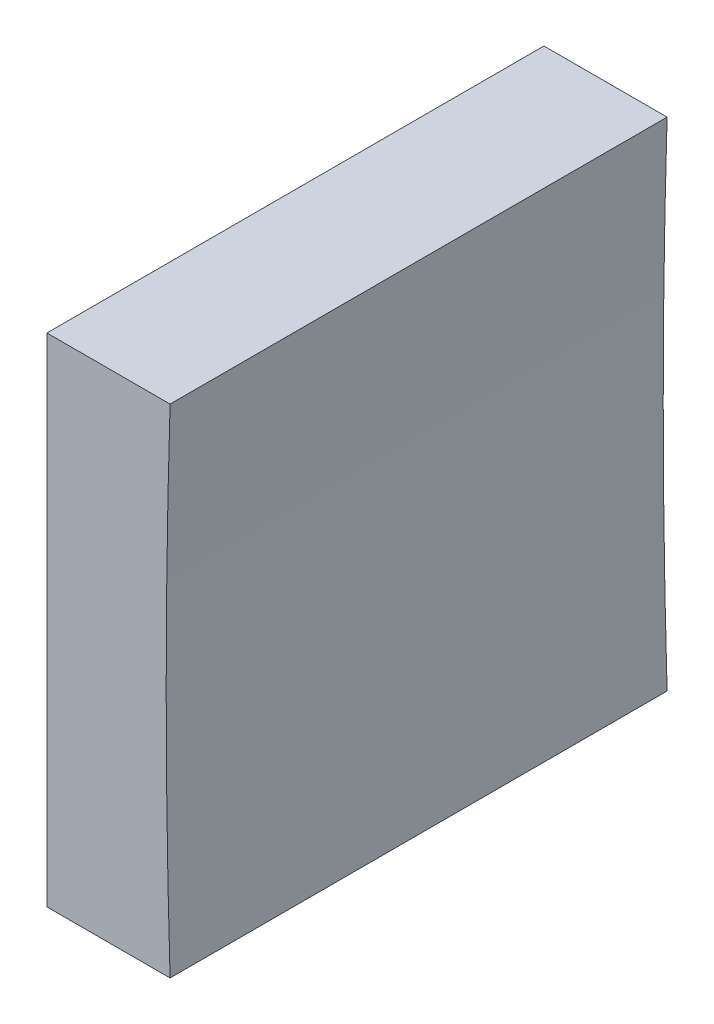
ISO-10303-21;
HEADER;
FILE_DESCRIPTION(('STEP AP214'),'2;1');
FILE_NAME('part.step','',(''),(''),'','','');
FILE_SCHEMA(('AUTOMOTIVE_DESIGN { 1 0 10303 214 1 1 1 1 }'));
ENDSEC;
DATA;
#1=APPLICATION_CONTEXT('core data for automotive mechanical design processes');
#2=APPLICATION_PROTOCOL_DEFINITION('international standard','automotive_design',2000,#1);
#3=PRODUCT_CONTEXT('',#1,'mechanical');
#4=PRODUCT('Part','Part','',(#3));
#5=PRODUCT_RELATED_PRODUCT_CATEGORY('part','',(#4));
#6=PRODUCT_DEFINITION_FORMATION('','',#4);
#7=PRODUCT_DEFINITION_CONTEXT('part definition',#1,'design');
#8=PRODUCT_DEFINITION('design','',#6,#7);
#9=PRODUCT_DEFINITION_SHAPE('','',#8);
#10=(LENGTH_UNIT() NAMED_UNIT(*) SI_UNIT(.MILLI.,.METRE.));
#11=(NAMED_UNIT(*) PLANE_ANGLE_UNIT() SI_UNIT($,.RADIAN.));
#12=(NAMED_UNIT(*) SI_UNIT($,.STERADIAN.) SOLID_ANGLE_UNIT());
#13=UNCERTAINTY_MEASURE_WITH_UNIT(LENGTH_MEASURE(1.E-05),#10,'distance_accuracy_value','');
#14=(GEOMETRIC_REPRESENTATION_CONTEXT(3) GLOBAL_UNCERTAINTY_ASSIGNED_CONTEXT((#13)) GLOBAL_UNIT_ASSIGNED_CONTEXT((#10,
#11,#12)) REPRESENTATION_CONTEXT('',''));
#15=CARTESIAN_POINT('',(0.,0.,0.));
#16=DIRECTION('',(0.,0.,1.));
#17=DIRECTION('',(1.,0.,0.));
#18=AXIS2_PLACEMENT_3D('',#15,#16,#17);
#19=CARTESIAN_POINT('',(290.902495825364,54.3579292677673,25.));
#20=DIRECTION('',(0.,1.,0.));
#21=DIRECTION('',(-1.,0.,0.));
#22=AXIS2_PLACEMENT_3D('',#19,#20,#21);
#23=PLANE('',#22);
#24=DIRECTION('',(1.,0.,0.));
#25=VECTOR('',#24,1.);
#26=CARTESIAN_POINT('',(290.902495825364,54.3579292677673,0.));
#27=LINE('',#26,#25);
#28=CARTESIAN_POINT('',(284.707135631282,54.3579292677671,0.));
#29=VERTEX_POINT('',#28);
#30=CARTESIAN_POINT('',(290.902495825364,54.3579292677674,0.));
#31=VERTEX_POINT('',#30);
#32=EDGE_CURVE('E91',#29,#31,#27,.T.);
#33=ORIENTED_EDGE('',*,*,#32,.T.);
#34=DIRECTION('',(0.,0.,-1.));
#35=VECTOR('',#34,1.);
#36=CARTESIAN_POINT('',(290.902495825364,54.3579292677674,25.));
#37=LINE('',#36,#35);
#38=CARTESIAN_POINT('',(290.902495825364,54.3579292677674,25.));
#39=VERTEX_POINT('',#38);
#40=EDGE_CURVE('E45',#39,#31,#37,.T.);
#41=ORIENTED_EDGE('',*,*,#40,.F.);
#42=DIRECTION('',(1.,0.,0.));
#43=VECTOR('',#42,1.);
#44=CARTESIAN_POINT('',(290.902495825364,54.3579292677673,25.));
#45=LINE('',#44,#43);
#46=CARTESIAN_POINT('',(284.707135631282,54.3579292677671,25.));
#47=VERTEX_POINT('',#46);
#48=EDGE_CURVE('E84',#47,#39,#45,.T.);
#49=ORIENTED_EDGE('',*,*,#48,.F.);
#50=DIRECTION('',(0.,0.,-1.));
#51=VECTOR('',#50,1.);
#52=CARTESIAN_POINT('',(284.707135631282,54.3579292677671,25.));
#53=LINE('',#52,#51);
#54=EDGE_CURVE('E11',#47,#29,#53,.T.);
#55=ORIENTED_EDGE('',*,*,#54,.T.);
#56=EDGE_LOOP('',(#33,#41,#49,#55));
#57=FACE_BOUND('',#56,.T.);
#58=ADVANCED_FACE('F37',(#57),#23,.F.);
#59=CARTESIAN_POINT('',(690.707135618351,66.8579292677672,25.));
#60=DIRECTION('',(0.,0.,-1.));
#61=DIRECTION('',(-1.,0.,0.));
#62=AXIS2_PLACEMENT_3D('',#59,#60,#61);
#63=CYLINDRICAL_SURFACE('',#62,400.);
#64=CARTESIAN_POINT('',(690.707135618351,66.8579292677672,0.));
#65=DIRECTION('',(0.,0.,-1.));
#66=DIRECTION('',(1.,0.,0.));
#67=AXIS2_PLACEMENT_3D('',#64,#65,#66);
#68=CIRCLE('',#67,400.);
#69=CARTESIAN_POINT('',(290.902495825364,79.3579292677671,0.));
#70=VERTEX_POINT('',#69);
#71=EDGE_CURVE('E71',#31,#70,#68,.T.);
#72=ORIENTED_EDGE('',*,*,#71,.T.);
#73=DIRECTION('',(0.,0.,-1.));
#74=VECTOR('',#73,1.);
#75=CARTESIAN_POINT('',(290.902495825364,79.3579292677671,25.));
#76=LINE('',#75,#74);
#77=CARTESIAN_POINT('',(290.902495825364,79.3579292677671,25.));
#78=VERTEX_POINT('',#77);
#79=EDGE_CURVE('E92',#78,#70,#76,.T.);
#80=ORIENTED_EDGE('',*,*,#79,.F.);
#81=CARTESIAN_POINT('',(690.707135618351,66.8579292677672,25.));
#82=DIRECTION('',(0.,0.,-1.));
#83=DIRECTION('',(1.,0.,0.));
#84=AXIS2_PLACEMENT_3D('',#81,#82,#83);
#85=CIRCLE('',#84,400.);
#86=EDGE_CURVE('E88',#39,#78,#85,.T.);
#87=ORIENTED_EDGE('',*,*,#86,.F.);
#88=ORIENTED_EDGE('',*,*,#40,.T.);
#89=EDGE_LOOP('',(#72,#80,#87,#88));
#90=FACE_BOUND('',#89,.T.);
#91=ADVANCED_FACE('F93',(#90),#63,.F.);
#92=CARTESIAN_POINT('',(284.707135631282,79.3579292677671,25.));
#93=DIRECTION('',(0.,-1.,0.));
#94=DIRECTION('',(0.,0.,-1.));
#95=AXIS2_PLACEMENT_3D('',#92,#93,#94);
#96=PLANE('',#95);
#97=DIRECTION('',(-1.,0.,0.));
#98=VECTOR('',#97,1.);
#99=CARTESIAN_POINT('',(284.707135631282,79.3579292677671,0.));
#100=LINE('',#99,#98);
#101=CARTESIAN_POINT('',(284.707135631282,79.3579292677671,0.));
#102=VERTEX_POINT('',#101);
#103=EDGE_CURVE('E78',#70,#102,#100,.T.);
#104=ORIENTED_EDGE('',*,*,#103,.T.);
#105=DIRECTION('',(0.,0.,-1.));
#106=VECTOR('',#105,1.);
#107=CARTESIAN_POINT('',(284.707135631282,79.3579292677671,25.));
#108=LINE('',#107,#106);
#109=CARTESIAN_POINT('',(284.707135631282,79.3579292677671,25.));
#110=VERTEX_POINT('',#109);
#111=EDGE_CURVE('E97',#110,#102,#108,.T.);
#112=ORIENTED_EDGE('',*,*,#111,.F.);
#113=DIRECTION('',(-1.,0.,0.));
#114=VECTOR('',#113,1.);
#115=CARTESIAN_POINT('',(284.707135631282,79.3579292677671,25.));
#116=LINE('',#115,#114);
#117=EDGE_CURVE('E95',#78,#110,#116,.T.);
#118=ORIENTED_EDGE('',*,*,#117,.F.);
#119=ORIENTED_EDGE('',*,*,#79,.T.);
#120=EDGE_LOOP('',(#104,#112,#118,#119));
#121=FACE_BOUND('',#120,.T.);
#122=ADVANCED_FACE('F107',(#121),#96,.F.);
#123=CARTESIAN_POINT('',(284.707135631282,66.8579292677671,25.));
#124=DIRECTION('',(1.,0.,0.));
#125=DIRECTION('',(0.,0.,-1.));
#126=AXIS2_PLACEMENT_3D('',#123,#124,#125);
#127=PLANE('',#126);
#128=DIRECTION('',(0.,-1.,0.));
#129=VECTOR('',#128,1.);
#130=CARTESIAN_POINT('',(284.707135631282,66.8579292677671,0.));
#131=LINE('',#130,#129);
#132=EDGE_CURVE('E104',#102,#29,#131,.T.);
#133=ORIENTED_EDGE('',*,*,#132,.T.);
#134=ORIENTED_EDGE('',*,*,#54,.F.);
#135=DIRECTION('',(0.,-1.,0.));
#136=VECTOR('',#135,1.);
#137=CARTESIAN_POINT('',(284.707135631282,54.3579292677671,25.));
#138=LINE('',#137,#136);
#139=EDGE_CURVE('E53',#110,#47,#138,.T.);
#140=ORIENTED_EDGE('',*,*,#139,.F.);
#141=ORIENTED_EDGE('',*,*,#111,.T.);
#142=EDGE_LOOP('',(#133,#134,#140,#141));
#143=FACE_BOUND('',#142,.T.);
#144=ADVANCED_FACE('F111',(#143),#127,.F.);
#145=CARTESIAN_POINT('',(690.707135618351,66.8579292677672,25.));
#146=DIRECTION('',(0.,0.,1.));
#147=DIRECTION('',(1.,0.,0.));
#148=AXIS2_PLACEMENT_3D('',#145,#146,#147);
#149=PLANE('',#148);
#150=ORIENTED_EDGE('',*,*,#139,.T.);
#151=ORIENTED_EDGE('',*,*,#48,.T.);
#152=ORIENTED_EDGE('',*,*,#86,.T.);
#153=ORIENTED_EDGE('',*,*,#117,.T.);
#154=EDGE_LOOP('',(#150,#151,#152,#153));
#155=FACE_BOUND('',#154,.T.);
#156=ADVANCED_FACE('F86',(#155),#149,.T.);
#157=CARTESIAN_POINT('',(690.707135618351,66.8579292677672,0.));
#158=DIRECTION('',(0.,0.,1.));
#159=DIRECTION('',(1.,0.,0.));
#160=AXIS2_PLACEMENT_3D('',#157,#158,#159);
#161=PLANE('',#160);
#162=ORIENTED_EDGE('',*,*,#32,.F.);
#163=ORIENTED_EDGE('',*,*,#132,.F.);
#164=ORIENTED_EDGE('',*,*,#103,.F.);
#165=ORIENTED_EDGE('',*,*,#71,.F.);
#166=EDGE_LOOP('',(#162,#163,#164,#165));
#167=FACE_BOUND('',#166,.T.);
#168=ADVANCED_FACE('F110',(#167),#161,.F.);
#169=CLOSED_SHELL('',(#58,#91,#122,#144,#156,#168));
#170=MANIFOLD_SOLID_BREP('B2',#169);
#171=ADVANCED_BREP_SHAPE_REPRESENTATION('',(#18,#170),#14);
#172=SHAPE_DEFINITION_REPRESENTATION(#9,#171);
ENDSEC;
END-ISO-10303-21;
